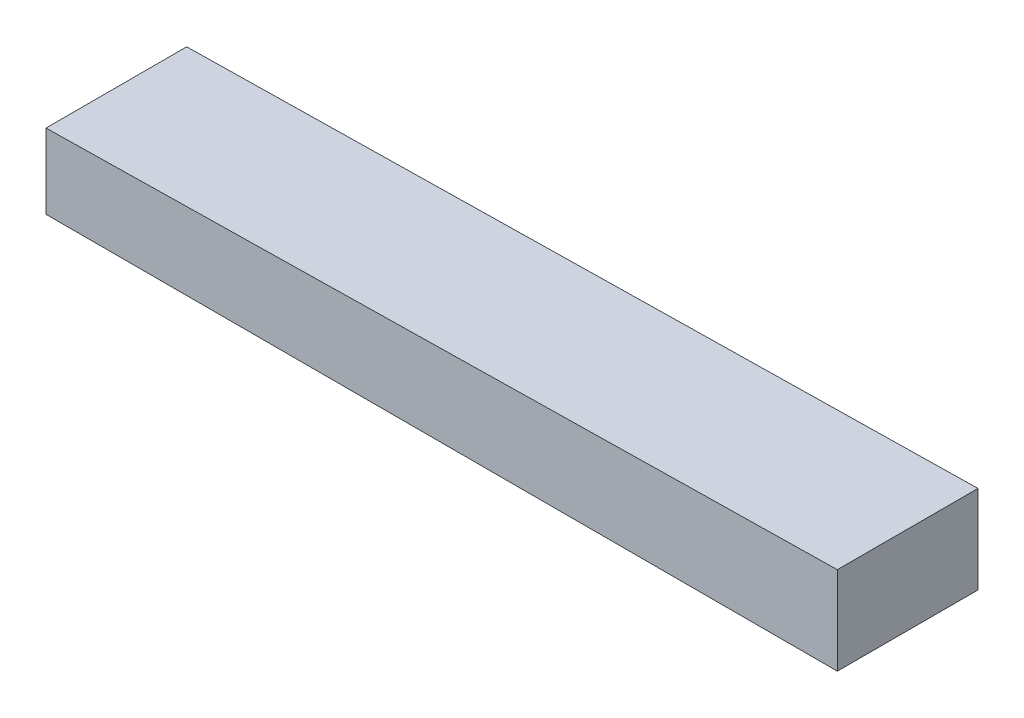
ISO-10303-21;
HEADER;
FILE_DESCRIPTION(('STEP AP214'),'2;1');
FILE_NAME('part.step','',(''),(''),'','','');
FILE_SCHEMA(('AUTOMOTIVE_DESIGN { 1 0 10303 214 1 1 1 1 }'));
ENDSEC;
DATA;
#1=APPLICATION_CONTEXT('core data for automotive mechanical design processes');
#2=APPLICATION_PROTOCOL_DEFINITION('international standard','automotive_design',2000,#1);
#3=PRODUCT_CONTEXT('',#1,'mechanical');
#4=PRODUCT('Part','Part','',(#3));
#5=PRODUCT_RELATED_PRODUCT_CATEGORY('part','',(#4));
#6=PRODUCT_DEFINITION_FORMATION('','',#4);
#7=PRODUCT_DEFINITION_CONTEXT('part definition',#1,'design');
#8=PRODUCT_DEFINITION('design','',#6,#7);
#9=PRODUCT_DEFINITION_SHAPE('','',#8);
#10=(LENGTH_UNIT() NAMED_UNIT(*) SI_UNIT(.MILLI.,.METRE.));
#11=(NAMED_UNIT(*) PLANE_ANGLE_UNIT() SI_UNIT($,.RADIAN.));
#12=(NAMED_UNIT(*) SI_UNIT($,.STERADIAN.) SOLID_ANGLE_UNIT());
#13=UNCERTAINTY_MEASURE_WITH_UNIT(LENGTH_MEASURE(1.E-05),#10,'distance_accuracy_value','');
#14=(GEOMETRIC_REPRESENTATION_CONTEXT(3) GLOBAL_UNCERTAINTY_ASSIGNED_CONTEXT((#13)) GLOBAL_UNIT_ASSIGNED_CONTEXT((#10,
#11,#12)) REPRESENTATION_CONTEXT('',''));
#15=CARTESIAN_POINT('',(0.,0.,0.));
#16=DIRECTION('',(0.,0.,1.));
#17=DIRECTION('',(1.,0.,0.));
#18=AXIS2_PLACEMENT_3D('',#15,#16,#17);
#19=CARTESIAN_POINT('',(45.,0.,16.));
#20=DIRECTION('',(-1.,0.,0.));
#21=DIRECTION('',(0.,0.,1.));
#22=AXIS2_PLACEMENT_3D('',#19,#20,#21);
#23=PLANE('',#22);
#24=DIRECTION('',(0.,1.,0.));
#25=VECTOR('',#24,1.);
#26=CARTESIAN_POINT('',(45.,0.,0.));
#27=LINE('',#26,#25);
#28=CARTESIAN_POINT('',(45.,0.,0.));
#29=VERTEX_POINT('',#28);
#30=CARTESIAN_POINT('',(45.,10.,0.));
#31=VERTEX_POINT('',#30);
#32=EDGE_CURVE('E96',#29,#31,#27,.T.);
#33=ORIENTED_EDGE('',*,*,#32,.T.);
#34=DIRECTION('',(0.,0.,-1.));
#35=VECTOR('',#34,1.);
#36=CARTESIAN_POINT('',(45.,10.,16.));
#37=LINE('',#36,#35);
#38=CARTESIAN_POINT('',(45.,10.,16.));
#39=VERTEX_POINT('',#38);
#40=EDGE_CURVE('E11',#39,#31,#37,.T.);
#41=ORIENTED_EDGE('',*,*,#40,.F.);
#42=DIRECTION('',(0.,1.,0.));
#43=VECTOR('',#42,1.);
#44=CARTESIAN_POINT('',(45.,0.,16.));
#45=LINE('',#44,#43);
#46=CARTESIAN_POINT('',(45.,0.,16.));
#47=VERTEX_POINT('',#46);
#48=EDGE_CURVE('E84',#47,#39,#45,.T.);
#49=ORIENTED_EDGE('',*,*,#48,.F.);
#50=DIRECTION('',(0.,0.,-1.));
#51=VECTOR('',#50,1.);
#52=CARTESIAN_POINT('',(45.,0.,16.));
#53=LINE('',#52,#51);
#54=EDGE_CURVE('E92',#47,#29,#53,.T.);
#55=ORIENTED_EDGE('',*,*,#54,.T.);
#56=EDGE_LOOP('',(#33,#41,#49,#55));
#57=FACE_BOUND('',#56,.T.);
#58=ADVANCED_FACE('F33',(#57),#23,.F.);
#59=CARTESIAN_POINT('',(-45.,8.5,16.));
#60=DIRECTION('',(0.0166643523339935,-0.9998611400396,0.));
#61=DIRECTION('',(0.9998611400396,0.0166643523339935,0.));
#62=AXIS2_PLACEMENT_3D('',#59,#60,#61);
#63=PLANE('',#62);
#64=DIRECTION('',(-0.9998611400396,-0.0166643523339935,0.));
#65=VECTOR('',#64,1.);
#66=CARTESIAN_POINT('',(-45.,8.5,0.));
#67=LINE('',#66,#65);
#68=CARTESIAN_POINT('',(-45.,8.5,0.));
#69=VERTEX_POINT('',#68);
#70=EDGE_CURVE('E88',#31,#69,#67,.T.);
#71=ORIENTED_EDGE('',*,*,#70,.T.);
#72=DIRECTION('',(0.,0.,-1.));
#73=VECTOR('',#72,1.);
#74=CARTESIAN_POINT('',(-45.,8.5,16.));
#75=LINE('',#74,#73);
#76=CARTESIAN_POINT('',(-45.,8.5,16.));
#77=VERTEX_POINT('',#76);
#78=EDGE_CURVE('E41',#77,#69,#75,.T.);
#79=ORIENTED_EDGE('',*,*,#78,.F.);
#80=DIRECTION('',(-0.9998611400396,-0.0166643523339935,0.));
#81=VECTOR('',#80,1.);
#82=CARTESIAN_POINT('',(-45.,8.5,16.));
#83=LINE('',#82,#81);
#84=EDGE_CURVE('E79',#39,#77,#83,.T.);
#85=ORIENTED_EDGE('',*,*,#84,.F.);
#86=ORIENTED_EDGE('',*,*,#40,.T.);
#87=EDGE_LOOP('',(#71,#79,#85,#86));
#88=FACE_BOUND('',#87,.T.);
#89=ADVANCED_FACE('F87',(#88),#63,.F.);
#90=CARTESIAN_POINT('',(-45.,0.,16.));
#91=DIRECTION('',(1.,0.,0.));
#92=DIRECTION('',(0.,0.,-1.));
#93=AXIS2_PLACEMENT_3D('',#90,#91,#92);
#94=PLANE('',#93);
#95=DIRECTION('',(0.,-1.,0.));
#96=VECTOR('',#95,1.);
#97=CARTESIAN_POINT('',(-45.,0.,0.));
#98=LINE('',#97,#96);
#99=CARTESIAN_POINT('',(-45.,0.,0.));
#100=VERTEX_POINT('',#99);
#101=EDGE_CURVE('E66',#69,#100,#98,.T.);
#102=ORIENTED_EDGE('',*,*,#101,.T.);
#103=DIRECTION('',(0.,0.,-1.));
#104=VECTOR('',#103,1.);
#105=CARTESIAN_POINT('',(-45.,0.,16.));
#106=LINE('',#105,#104);
#107=CARTESIAN_POINT('',(-45.,0.,16.));
#108=VERTEX_POINT('',#107);
#109=EDGE_CURVE('E89',#108,#100,#106,.T.);
#110=ORIENTED_EDGE('',*,*,#109,.F.);
#111=DIRECTION('',(0.,-1.,0.));
#112=VECTOR('',#111,1.);
#113=CARTESIAN_POINT('',(-45.,0.,16.));
#114=LINE('',#113,#112);
#115=EDGE_CURVE('E82',#77,#108,#114,.T.);
#116=ORIENTED_EDGE('',*,*,#115,.F.);
#117=ORIENTED_EDGE('',*,*,#78,.T.);
#118=EDGE_LOOP('',(#102,#110,#116,#117));
#119=FACE_BOUND('',#118,.T.);
#120=ADVANCED_FACE('F90',(#119),#94,.F.);
#121=CARTESIAN_POINT('',(-45.,0.,16.));
#122=DIRECTION('',(0.,1.,0.));
#123=DIRECTION('',(-1.,0.,0.));
#124=AXIS2_PLACEMENT_3D('',#121,#122,#123);
#125=PLANE('',#124);
#126=DIRECTION('',(1.,0.,0.));
#127=VECTOR('',#126,1.);
#128=CARTESIAN_POINT('',(-45.,0.,0.));
#129=LINE('',#128,#127);
#130=EDGE_CURVE('E72',#100,#29,#129,.T.);
#131=ORIENTED_EDGE('',*,*,#130,.T.);
#132=ORIENTED_EDGE('',*,*,#54,.F.);
#133=DIRECTION('',(1.,0.,0.));
#134=VECTOR('',#133,1.);
#135=CARTESIAN_POINT('',(-45.,0.,16.));
#136=LINE('',#135,#134);
#137=EDGE_CURVE('E49',#108,#47,#136,.T.);
#138=ORIENTED_EDGE('',*,*,#137,.F.);
#139=ORIENTED_EDGE('',*,*,#109,.T.);
#140=EDGE_LOOP('',(#131,#132,#138,#139));
#141=FACE_BOUND('',#140,.T.);
#142=ADVANCED_FACE('F103',(#141),#125,.F.);
#143=CARTESIAN_POINT('',(0.,0.,16.));
#144=DIRECTION('',(0.,0.,-1.));
#145=DIRECTION('',(-1.,0.,0.));
#146=AXIS2_PLACEMENT_3D('',#143,#144,#145);
#147=PLANE('',#146);
#148=ORIENTED_EDGE('',*,*,#48,.T.);
#149=ORIENTED_EDGE('',*,*,#84,.T.);
#150=ORIENTED_EDGE('',*,*,#115,.T.);
#151=ORIENTED_EDGE('',*,*,#137,.T.);
#152=EDGE_LOOP('',(#148,#149,#150,#151));
#153=FACE_BOUND('',#152,.T.);
#154=ADVANCED_FACE('F80',(#153),#147,.F.);
#155=CARTESIAN_POINT('',(0.,0.,0.));
#156=DIRECTION('',(0.,0.,-1.));
#157=DIRECTION('',(-1.,0.,0.));
#158=AXIS2_PLACEMENT_3D('',#155,#156,#157);
#159=PLANE('',#158);
#160=ORIENTED_EDGE('',*,*,#32,.F.);
#161=ORIENTED_EDGE('',*,*,#130,.F.);
#162=ORIENTED_EDGE('',*,*,#101,.F.);
#163=ORIENTED_EDGE('',*,*,#70,.F.);
#164=EDGE_LOOP('',(#160,#161,#162,#163));
#165=FACE_BOUND('',#164,.T.);
#166=ADVANCED_FACE('F106',(#165),#159,.T.);
#167=CLOSED_SHELL('',(#58,#89,#120,#142,#154,#166));
#168=MANIFOLD_SOLID_BREP('B2',#167);
#169=ADVANCED_BREP_SHAPE_REPRESENTATION('',(#18,#168),#14);
#170=SHAPE_DEFINITION_REPRESENTATION(#9,#169);
ENDSEC;
END-ISO-10303-21;
